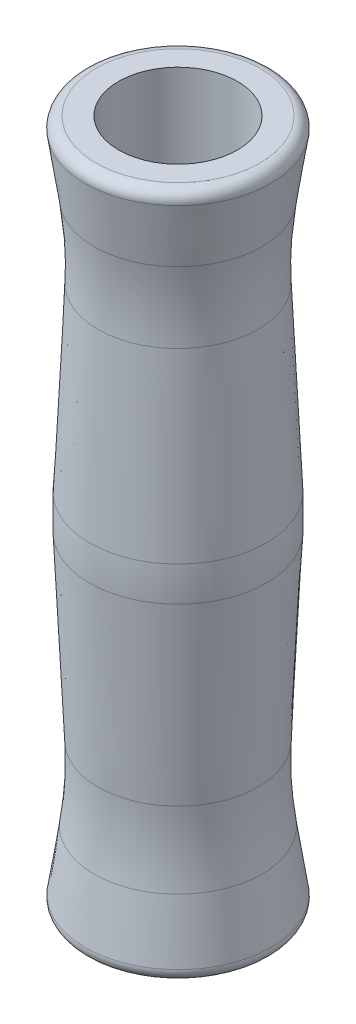
ISO-10303-21;
HEADER;
FILE_DESCRIPTION(('STEP AP214'),'2;1');
FILE_NAME('part.step','',(''),(''),'','','');
FILE_SCHEMA(('AUTOMOTIVE_DESIGN { 1 0 10303 214 1 1 1 1 }'));
ENDSEC;
DATA;
#1=APPLICATION_CONTEXT('core data for automotive mechanical design processes');
#2=APPLICATION_PROTOCOL_DEFINITION('international standard','automotive_design',2000,#1);
#3=PRODUCT_CONTEXT('',#1,'mechanical');
#4=PRODUCT('Part','Part','',(#3));
#5=PRODUCT_RELATED_PRODUCT_CATEGORY('part','',(#4));
#6=PRODUCT_DEFINITION_FORMATION('','',#4);
#7=PRODUCT_DEFINITION_CONTEXT('part definition',#1,'design');
#8=PRODUCT_DEFINITION('design','',#6,#7);
#9=PRODUCT_DEFINITION_SHAPE('','',#8);
#10=(LENGTH_UNIT() NAMED_UNIT(*) SI_UNIT(.MILLI.,.METRE.));
#11=(NAMED_UNIT(*) PLANE_ANGLE_UNIT() SI_UNIT($,.RADIAN.));
#12=(NAMED_UNIT(*) SI_UNIT($,.STERADIAN.) SOLID_ANGLE_UNIT());
#13=UNCERTAINTY_MEASURE_WITH_UNIT(LENGTH_MEASURE(1.E-05),#10,'distance_accuracy_value','');
#14=(GEOMETRIC_REPRESENTATION_CONTEXT(3) GLOBAL_UNCERTAINTY_ASSIGNED_CONTEXT((#13)) GLOBAL_UNIT_ASSIGNED_CONTEXT((#10,
#11,#12)) REPRESENTATION_CONTEXT('',''));
#15=CARTESIAN_POINT('',(0.,0.,0.));
#16=DIRECTION('',(0.,0.,1.));
#17=DIRECTION('',(1.,0.,0.));
#18=AXIS2_PLACEMENT_3D('',#15,#16,#17);
#19=CARTESIAN_POINT('',(0.,-127.,0.));
#20=DIRECTION('',(0.,1.,0.));
#21=DIRECTION('',(0.,0.,1.));
#22=AXIS2_PLACEMENT_3D('',#19,#20,#21);
#23=PLANE('',#22);
#24=CARTESIAN_POINT('',(0.,-127.,0.));
#25=DIRECTION('',(0.,1.,0.));
#26=DIRECTION('',(0.,0.,1.));
#27=AXIS2_PLACEMENT_3D('',#24,#25,#26);
#28=CIRCLE('',#27,11.);
#29=CARTESIAN_POINT('',(0.,-127.,11.));
#30=VERTEX_POINT('',#29);
#31=EDGE_CURVE('E70',#30,#30,#28,.T.);
#32=ORIENTED_EDGE('',*,*,#31,.T.);
#33=EDGE_LOOP('',(#32));
#34=FACE_BOUND('',#33,.T.);
#35=CARTESIAN_POINT('',(0.,-127.,0.));
#36=DIRECTION('',(0.,1.,0.));
#37=DIRECTION('',(0.,0.,1.));
#38=AXIS2_PLACEMENT_3D('',#35,#36,#37);
#39=CIRCLE('',#38,15.1776251583843);
#40=CARTESIAN_POINT('',(0.,-127.,15.1776251583843));
#41=VERTEX_POINT('',#40);
#42=EDGE_CURVE('E64',#41,#41,#39,.F.);
#43=ORIENTED_EDGE('',*,*,#42,.T.);
#44=EDGE_LOOP('',(#43));
#45=FACE_BOUND('',#44,.T.);
#46=ADVANCED_FACE('F32',(#34,#45),#23,.F.);
#47=CARTESIAN_POINT('',(0.,-127.,0.));
#48=DIRECTION('',(0.,-1.,0.));
#49=DIRECTION('',(0.,0.,-1.));
#50=AXIS2_PLACEMENT_3D('',#47,#48,#49);
#51=CONICAL_SURFACE('',#50,17.5,0.148889947609497);
#52=CARTESIAN_POINT('',(0.,-113.765180140609,0.));
#53=DIRECTION('',(0.,-1.,0.));
#54=DIRECTION('',(0.,0.,-1.));
#55=AXIS2_PLACEMENT_3D('',#52,#53,#54);
#56=CIRCLE('',#55,15.5147770210913);
#57=CARTESIAN_POINT('',(0.,-113.765180140609,-15.5147770210913));
#58=VERTEX_POINT('',#57);
#59=EDGE_CURVE('E47',#58,#58,#56,.T.);
#60=ORIENTED_EDGE('',*,*,#59,.T.);
#61=EDGE_LOOP('',(#60));
#62=FACE_BOUND('',#61,.T.);
#63=CARTESIAN_POINT('',(0.,-124.70331909414,0.));
#64=DIRECTION('',(0.,1.,0.));
#65=DIRECTION('',(0.,0.,1.));
#66=AXIS2_PLACEMENT_3D('',#63,#64,#65);
#67=CIRCLE('',#66,17.1554978641209);
#68=CARTESIAN_POINT('',(0.,-124.70331909414,17.1554978641209));
#69=VERTEX_POINT('',#68);
#70=EDGE_CURVE('E67',#69,#69,#67,.T.);
#71=ORIENTED_EDGE('',*,*,#70,.T.);
#72=EDGE_LOOP('',(#71));
#73=FACE_BOUND('',#72,.T.);
#74=ADVANCED_FACE('F109',(#62,#73),#51,.T.);
#75=CARTESIAN_POINT('',(0.,-107.,0.));
#76=DIRECTION('',(0.,1.,0.));
#77=DIRECTION('',(0.,0.,1.));
#78=AXIS2_PLACEMENT_3D('',#75,#76,#77);
#79=CONICAL_SURFACE('',#78,14.5,0.0459446558081198);
#80=CARTESIAN_POINT('',(0.,-100.16635390231,0.));
#81=DIRECTION('',(0.,1.,0.));
#82=DIRECTION('',(0.,0.,1.));
#83=AXIS2_PLACEMENT_3D('',#80,#81,#82);
#84=CIRCLE('',#83,14.8141906251811);
#85=CARTESIAN_POINT('',(0.,-100.16635390231,14.8141906251811));
#86=VERTEX_POINT('',#85);
#87=EDGE_CURVE('E52',#86,#86,#84,.T.);
#88=ORIENTED_EDGE('',*,*,#87,.T.);
#89=EDGE_LOOP('',(#88));
#90=FACE_BOUND('',#89,.T.);
#91=CARTESIAN_POINT('',(0.,-66.7149945331812,0.));
#92=DIRECTION('',(0.,-1.,0.));
#93=DIRECTION('',(0.,0.,-1.));
#94=AXIS2_PLACEMENT_3D('',#91,#92,#93);
#95=CIRCLE('',#94,16.352184159394);
#96=CARTESIAN_POINT('',(0.,-66.7149945331812,-16.352184159394));
#97=VERTEX_POINT('',#96);
#98=EDGE_CURVE('E55',#97,#97,#95,.T.);
#99=ORIENTED_EDGE('',*,*,#98,.T.);
#100=EDGE_LOOP('',(#99));
#101=FACE_BOUND('',#100,.T.);
#102=ADVANCED_FACE('F114',(#90,#101),#79,.T.);
#103=CARTESIAN_POINT('',(0.,-63.5,0.));
#104=DIRECTION('',(0.,-1.,0.));
#105=DIRECTION('',(0.,0.,-1.));
#106=AXIS2_PLACEMENT_3D('',#103,#104,#105);
#107=CONICAL_SURFACE('',#106,16.5,0.0459446558081198);
#108=CARTESIAN_POINT('',(0.,-26.8336460976897,0.));
#109=DIRECTION('',(0.,-1.,0.));
#110=DIRECTION('',(0.,0.,-1.));
#111=AXIS2_PLACEMENT_3D('',#108,#109,#110);
#112=CIRCLE('',#111,14.8141906251811);
#113=CARTESIAN_POINT('',(0.,-26.8336460976897,-14.8141906251811));
#114=VERTEX_POINT('',#113);
#115=EDGE_CURVE('E10',#114,#114,#112,.T.);
#116=ORIENTED_EDGE('',*,*,#115,.T.);
#117=EDGE_LOOP('',(#116));
#118=FACE_BOUND('',#117,.T.);
#119=CARTESIAN_POINT('',(0.,-60.2850054668188,0.));
#120=DIRECTION('',(0.,1.,0.));
#121=DIRECTION('',(0.,0.,1.));
#122=AXIS2_PLACEMENT_3D('',#119,#120,#121);
#123=CIRCLE('',#122,16.352184159394);
#124=CARTESIAN_POINT('',(0.,-60.2850054668188,16.352184159394));
#125=VERTEX_POINT('',#124);
#126=EDGE_CURVE('E39',#125,#125,#123,.T.);
#127=ORIENTED_EDGE('',*,*,#126,.T.);
#128=EDGE_LOOP('',(#127));
#129=FACE_BOUND('',#128,.T.);
#130=ADVANCED_FACE('F120',(#118,#129),#107,.T.);
#131=CARTESIAN_POINT('',(0.,-20.,0.));
#132=DIRECTION('',(0.,1.,0.));
#133=DIRECTION('',(0.,0.,1.));
#134=AXIS2_PLACEMENT_3D('',#131,#132,#133);
#135=CONICAL_SURFACE('',#134,14.5,0.148889947609497);
#136=CARTESIAN_POINT('',(0.,-13.2348198593914,0.));
#137=DIRECTION('',(0.,1.,0.));
#138=DIRECTION('',(0.,0.,1.));
#139=AXIS2_PLACEMENT_3D('',#136,#137,#138);
#140=CIRCLE('',#139,15.5147770210913);
#141=CARTESIAN_POINT('',(0.,-13.2348198593914,15.5147770210913));
#142=VERTEX_POINT('',#141);
#143=EDGE_CURVE('E43',#142,#142,#140,.T.);
#144=ORIENTED_EDGE('',*,*,#143,.T.);
#145=EDGE_LOOP('',(#144));
#146=FACE_BOUND('',#145,.T.);
#147=CARTESIAN_POINT('',(0.,-2.29668090586048,0.));
#148=DIRECTION('',(0.,-1.,0.));
#149=DIRECTION('',(0.,0.,-1.));
#150=AXIS2_PLACEMENT_3D('',#147,#148,#149);
#151=CIRCLE('',#150,17.1554978641209);
#152=CARTESIAN_POINT('',(0.,-2.29668090586048,-17.1554978641209));
#153=VERTEX_POINT('',#152);
#154=EDGE_CURVE('E58',#153,#153,#151,.T.);
#155=ORIENTED_EDGE('',*,*,#154,.T.);
#156=EDGE_LOOP('',(#155));
#157=FACE_BOUND('',#156,.T.);
#158=ADVANCED_FACE('F89',(#146,#157),#135,.T.);
#159=CARTESIAN_POINT('',(0.,0.,0.));
#160=DIRECTION('',(0.,-1.,0.));
#161=DIRECTION('',(0.,0.,-1.));
#162=AXIS2_PLACEMENT_3D('',#159,#160,#161);
#163=PLANE('',#162);
#164=CARTESIAN_POINT('',(0.,0.,0.));
#165=DIRECTION('',(0.,1.,0.));
#166=DIRECTION('',(0.,0.,1.));
#167=AXIS2_PLACEMENT_3D('',#164,#165,#166);
#168=CIRCLE('',#167,11.);
#169=CARTESIAN_POINT('',(0.,0.,11.));
#170=VERTEX_POINT('',#169);
#171=EDGE_CURVE('E71',#170,#170,#168,.T.);
#172=ORIENTED_EDGE('',*,*,#171,.F.);
#173=EDGE_LOOP('',(#172));
#174=FACE_BOUND('',#173,.T.);
#175=CARTESIAN_POINT('',(0.,0.,0.));
#176=DIRECTION('',(0.,-1.,0.));
#177=DIRECTION('',(0.,0.,-1.));
#178=AXIS2_PLACEMENT_3D('',#175,#176,#177);
#179=CIRCLE('',#178,15.1776251583843);
#180=CARTESIAN_POINT('',(0.,0.,-15.1776251583843));
#181=VERTEX_POINT('',#180);
#182=EDGE_CURVE('E61',#181,#181,#179,.F.);
#183=ORIENTED_EDGE('',*,*,#182,.T.);
#184=EDGE_LOOP('',(#183));
#185=FACE_BOUND('',#184,.T.);
#186=ADVANCED_FACE('F85',(#174,#185),#163,.F.);
#187=CARTESIAN_POINT('',(0.,-125.,0.));
#188=DIRECTION('',(0.,1.,0.));
#189=DIRECTION('',(0.,0.,1.));
#190=AXIS2_PLACEMENT_3D('',#187,#188,#189);
#191=TOROIDAL_SURFACE('',#190,15.1776251583843,2.);
#192=ORIENTED_EDGE('',*,*,#42,.F.);
#193=EDGE_LOOP('',(#192));
#194=FACE_BOUND('',#193,.T.);
#195=ORIENTED_EDGE('',*,*,#70,.F.);
#196=EDGE_LOOP('',(#195));
#197=FACE_BOUND('',#196,.T.);
#198=ADVANCED_FACE('F88',(#194,#197),#191,.T.);
#199=CARTESIAN_POINT('',(0.,-2.,0.));
#200=DIRECTION('',(0.,-1.,0.));
#201=DIRECTION('',(0.,0.,-1.));
#202=AXIS2_PLACEMENT_3D('',#199,#200,#201);
#203=TOROIDAL_SURFACE('',#202,15.1776251583843,2.);
#204=ORIENTED_EDGE('',*,*,#154,.F.);
#205=EDGE_LOOP('',(#204));
#206=FACE_BOUND('',#205,.T.);
#207=ORIENTED_EDGE('',*,*,#182,.F.);
#208=EDGE_LOOP('',(#207));
#209=FACE_BOUND('',#208,.T.);
#210=ADVANCED_FACE('F93',(#206,#209),#203,.T.);
#211=CARTESIAN_POINT('',(0.,-103.381348435491,0.));
#212=DIRECTION('',(0.,1.,0.));
#213=DIRECTION('',(0.,0.,1.));
#214=AXIS2_PLACEMENT_3D('',#211,#212,#213);
#215=TOROIDAL_SURFACE('',#214,84.7403217218721,70.);
#216=ORIENTED_EDGE('',*,*,#59,.F.);
#217=EDGE_LOOP('',(#216));
#218=FACE_BOUND('',#217,.T.);
#219=ORIENTED_EDGE('',*,*,#87,.F.);
#220=EDGE_LOOP('',(#219));
#221=FACE_BOUND('',#220,.T.);
#222=ADVANCED_FACE('F95',(#218,#221),#215,.F.);
#223=CARTESIAN_POINT('',(0.,-23.6186515645085,0.));
#224=DIRECTION('',(0.,1.,0.));
#225=DIRECTION('',(0.,0.,1.));
#226=AXIS2_PLACEMENT_3D('',#223,#224,#225);
#227=TOROIDAL_SURFACE('',#226,84.7403217218721,70.);
#228=ORIENTED_EDGE('',*,*,#115,.F.);
#229=EDGE_LOOP('',(#228));
#230=FACE_BOUND('',#229,.T.);
#231=ORIENTED_EDGE('',*,*,#143,.F.);
#232=EDGE_LOOP('',(#231));
#233=FACE_BOUND('',#232,.T.);
#234=ADVANCED_FACE('F102',(#230,#233),#227,.F.);
#235=CARTESIAN_POINT('',(0.,-63.5,0.));
#236=DIRECTION('',(0.,-1.,0.));
#237=DIRECTION('',(0.,0.,-1.));
#238=AXIS2_PLACEMENT_3D('',#235,#236,#237);
#239=DEGENERATE_TOROIDAL_SURFACE('',#238,53.573946937297,70.,.F.);
#240=ORIENTED_EDGE('',*,*,#98,.F.);
#241=EDGE_LOOP('',(#240));
#242=FACE_BOUND('',#241,.T.);
#243=ORIENTED_EDGE('',*,*,#126,.F.);
#244=EDGE_LOOP('',(#243));
#245=FACE_BOUND('',#244,.T.);
#246=ADVANCED_FACE('F34',(#242,#245),#239,.F.);
#247=CARTESIAN_POINT('',(0.,-127.,0.));
#248=DIRECTION('',(0.,1.,0.));
#249=DIRECTION('',(0.,0.,1.));
#250=AXIS2_PLACEMENT_3D('',#247,#248,#249);
#251=CYLINDRICAL_SURFACE('',#250,11.);
#252=ORIENTED_EDGE('',*,*,#31,.F.);
#253=EDGE_LOOP('',(#252));
#254=FACE_BOUND('',#253,.T.);
#255=ORIENTED_EDGE('',*,*,#171,.T.);
#256=EDGE_LOOP('',(#255));
#257=FACE_BOUND('',#256,.T.);
#258=ADVANCED_FACE('F79',(#254,#257),#251,.F.);
#259=CLOSED_SHELL('',(#46,#74,#102,#130,#158,#186,#198,#210,#222,#234,#246,#258));
#260=MANIFOLD_SOLID_BREP('B2',#259);
#261=ADVANCED_BREP_SHAPE_REPRESENTATION('',(#18,#260),#14);
#262=SHAPE_DEFINITION_REPRESENTATION(#9,#261);
ENDSEC;
END-ISO-10303-21;
